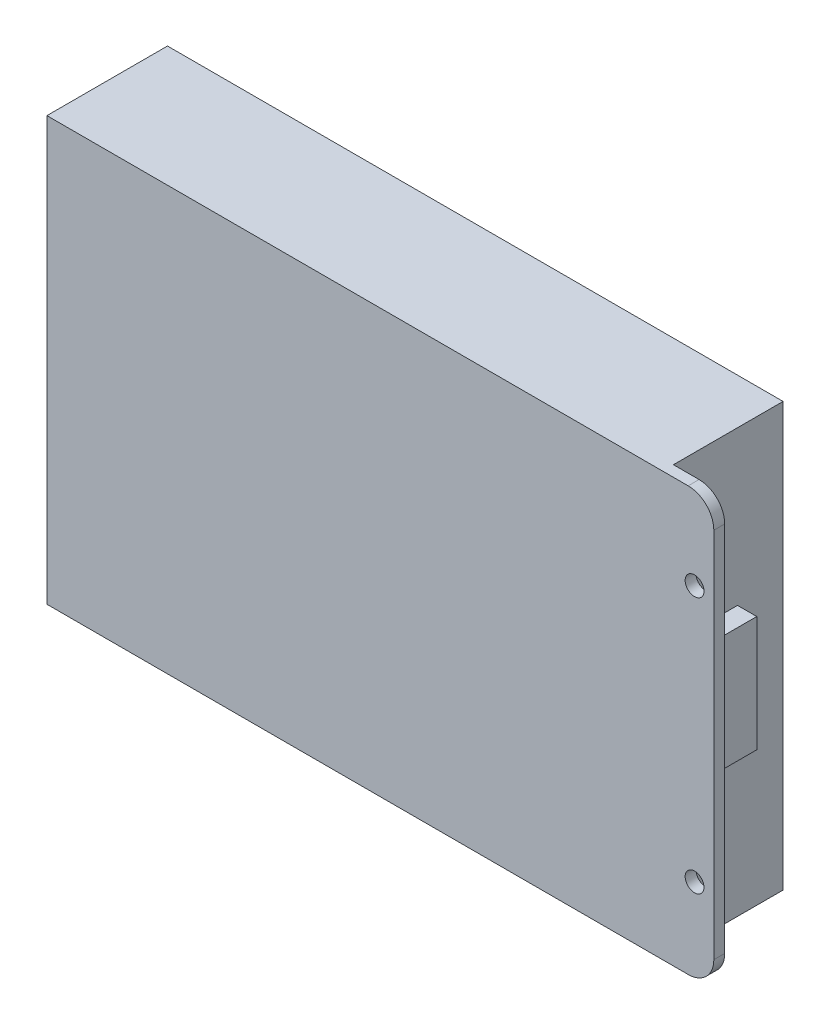
ISO-10303-21;
HEADER;
FILE_DESCRIPTION(('STEP AP214'),'2;1');
FILE_NAME('part.step','',(''),(''),'','','');
FILE_SCHEMA(('AUTOMOTIVE_DESIGN { 1 0 10303 214 1 1 1 1 }'));
ENDSEC;
DATA;
#1=APPLICATION_CONTEXT('core data for automotive mechanical design processes');
#2=APPLICATION_PROTOCOL_DEFINITION('international standard','automotive_design',2000,#1);
#3=PRODUCT_CONTEXT('',#1,'mechanical');
#4=PRODUCT('Part','Part','',(#3));
#5=PRODUCT_RELATED_PRODUCT_CATEGORY('part','',(#4));
#6=PRODUCT_DEFINITION_FORMATION('','',#4);
#7=PRODUCT_DEFINITION_CONTEXT('part definition',#1,'design');
#8=PRODUCT_DEFINITION('design','',#6,#7);
#9=PRODUCT_DEFINITION_SHAPE('','',#8);
#10=(LENGTH_UNIT() NAMED_UNIT(*) SI_UNIT(.MILLI.,.METRE.));
#11=(NAMED_UNIT(*) PLANE_ANGLE_UNIT() SI_UNIT($,.RADIAN.));
#12=(NAMED_UNIT(*) SI_UNIT($,.STERADIAN.) SOLID_ANGLE_UNIT());
#13=UNCERTAINTY_MEASURE_WITH_UNIT(LENGTH_MEASURE(1.E-05),#10,'distance_accuracy_value','');
#14=(GEOMETRIC_REPRESENTATION_CONTEXT(3) GLOBAL_UNCERTAINTY_ASSIGNED_CONTEXT((#13)) GLOBAL_UNIT_ASSIGNED_CONTEXT((#10,
#11,#12)) REPRESENTATION_CONTEXT('',''));
#15=CARTESIAN_POINT('',(0.,0.,0.));
#16=DIRECTION('',(0.,0.,1.));
#17=DIRECTION('',(1.,0.,0.));
#18=AXIS2_PLACEMENT_3D('',#15,#16,#17);
#19=CARTESIAN_POINT('',(48.,-33.,17.1));
#20=DIRECTION('',(-1.,0.,0.));
#21=DIRECTION('',(0.,0.,1.));
#22=AXIS2_PLACEMENT_3D('',#19,#20,#21);
#23=PLANE('',#22);
#24=DIRECTION('',(0.,0.,-1.));
#25=VECTOR('',#24,1.);
#26=CARTESIAN_POINT('',(48.,-9.,17.1));
#27=LINE('',#26,#25);
#28=CARTESIAN_POINT('',(48.,-9.,17.1));
#29=VERTEX_POINT('',#28);
#30=CARTESIAN_POINT('',(48.,-9.,7.1));
#31=VERTEX_POINT('',#30);
#32=EDGE_CURVE('E134',#29,#31,#27,.T.);
#33=ORIENTED_EDGE('',*,*,#32,.F.);
#34=DIRECTION('',(0.,1.,0.));
#35=VECTOR('',#34,1.);
#36=CARTESIAN_POINT('',(48.,-33.,17.1));
#37=LINE('',#36,#35);
#38=CARTESIAN_POINT('',(48.,-33.,17.1));
#39=VERTEX_POINT('',#38);
#40=EDGE_CURVE('E106',#39,#29,#37,.T.);
#41=ORIENTED_EDGE('',*,*,#40,.F.);
#42=DIRECTION('',(0.,0.,-1.));
#43=VECTOR('',#42,1.);
#44=CARTESIAN_POINT('',(48.,-33.,17.1));
#45=LINE('',#44,#43);
#46=CARTESIAN_POINT('',(48.,-33.,0.));
#47=VERTEX_POINT('',#46);
#48=EDGE_CURVE('E62',#39,#47,#45,.T.);
#49=ORIENTED_EDGE('',*,*,#48,.T.);
#50=DIRECTION('',(0.,1.,0.));
#51=VECTOR('',#50,1.);
#52=CARTESIAN_POINT('',(48.,-33.,0.));
#53=LINE('',#52,#51);
#54=CARTESIAN_POINT('',(48.,33.,0.));
#55=VERTEX_POINT('',#54);
#56=EDGE_CURVE('E102',#47,#55,#53,.T.);
#57=ORIENTED_EDGE('',*,*,#56,.T.);
#58=DIRECTION('',(0.,0.,-1.));
#59=VECTOR('',#58,1.);
#60=CARTESIAN_POINT('',(48.,33.,17.1));
#61=LINE('',#60,#59);
#62=CARTESIAN_POINT('',(48.,33.,17.1));
#63=VERTEX_POINT('',#62);
#64=EDGE_CURVE('E11',#63,#55,#61,.T.);
#65=ORIENTED_EDGE('',*,*,#64,.F.);
#66=CARTESIAN_POINT('',(48.,9.,17.1));
#67=VERTEX_POINT('',#66);
#68=EDGE_CURVE('E103',#67,#63,#37,.T.);
#69=ORIENTED_EDGE('',*,*,#68,.F.);
#70=DIRECTION('',(0.,0.,1.));
#71=VECTOR('',#70,1.);
#72=CARTESIAN_POINT('',(48.,9.,17.1));
#73=LINE('',#72,#71);
#74=CARTESIAN_POINT('',(48.,9.,7.1));
#75=VERTEX_POINT('',#74);
#76=EDGE_CURVE('E286',#75,#67,#73,.T.);
#77=ORIENTED_EDGE('',*,*,#76,.F.);
#78=DIRECTION('',(0.,1.,0.));
#79=VECTOR('',#78,1.);
#80=CARTESIAN_POINT('',(48.,9.,7.1));
#81=LINE('',#80,#79);
#82=EDGE_CURVE('E276',#31,#75,#81,.T.);
#83=ORIENTED_EDGE('',*,*,#82,.F.);
#84=EDGE_LOOP('',(#33,#41,#49,#57,#65,#69,#77,#83));
#85=FACE_BOUND('',#84,.T.);
#86=ADVANCED_FACE('F39',(#85),#23,.F.);
#87=CARTESIAN_POINT('',(52.,-29.,17.1));
#88=DIRECTION('',(0.,0.,1.));
#89=DIRECTION('',(1.,0.,0.));
#90=AXIS2_PLACEMENT_3D('',#87,#88,#89);
#91=PLANE('',#90);
#92=CARTESIAN_POINT('',(53.,20.,17.1));
#93=DIRECTION('',(0.,0.,1.));
#94=DIRECTION('',(1.,0.,0.));
#95=AXIS2_PLACEMENT_3D('',#92,#93,#94);
#96=CIRCLE('',#95,1.47);
#97=CARTESIAN_POINT('',(54.47,20.,17.1));
#98=VERTEX_POINT('',#97);
#99=EDGE_CURVE('E273',#98,#98,#96,.T.);
#100=ORIENTED_EDGE('',*,*,#99,.T.);
#101=EDGE_LOOP('',(#100));
#102=FACE_BOUND('',#101,.T.);
#103=CARTESIAN_POINT('',(53.,-20.,17.1));
#104=DIRECTION('',(0.,0.,1.));
#105=DIRECTION('',(1.,0.,0.));
#106=AXIS2_PLACEMENT_3D('',#103,#104,#105);
#107=CIRCLE('',#106,1.47);
#108=CARTESIAN_POINT('',(54.47,-20.,17.1));
#109=VERTEX_POINT('',#108);
#110=EDGE_CURVE('E274',#109,#109,#107,.T.);
#111=ORIENTED_EDGE('',*,*,#110,.T.);
#112=EDGE_LOOP('',(#111));
#113=FACE_BOUND('',#112,.T.);
#114=DIRECTION('',(-1.,0.,0.));
#115=VECTOR('',#114,1.);
#116=CARTESIAN_POINT('',(51.,-9.,17.1));
#117=LINE('',#116,#115);
#118=CARTESIAN_POINT('',(51.,-9.,17.1));
#119=VERTEX_POINT('',#118);
#120=EDGE_CURVE('E304',#119,#29,#117,.T.);
#121=ORIENTED_EDGE('',*,*,#120,.F.);
#122=DIRECTION('',(0.,-1.,0.));
#123=VECTOR('',#122,1.);
#124=CARTESIAN_POINT('',(51.,9.,17.1));
#125=LINE('',#124,#123);
#126=CARTESIAN_POINT('',(51.,9.,17.1));
#127=VERTEX_POINT('',#126);
#128=EDGE_CURVE('E282',#127,#119,#125,.T.);
#129=ORIENTED_EDGE('',*,*,#128,.F.);
#130=DIRECTION('',(-1.,0.,0.));
#131=VECTOR('',#130,1.);
#132=CARTESIAN_POINT('',(51.,9.,17.1));
#133=LINE('',#132,#131);
#134=EDGE_CURVE('E53',#127,#67,#133,.T.);
#135=ORIENTED_EDGE('',*,*,#134,.T.);
#136=ORIENTED_EDGE('',*,*,#68,.T.);
#137=DIRECTION('',(-1.,0.,0.));
#138=VECTOR('',#137,1.);
#139=CARTESIAN_POINT('',(-48.,33.,17.1));
#140=LINE('',#139,#138);
#141=CARTESIAN_POINT('',(52.,33.,17.1));
#142=VERTEX_POINT('',#141);
#143=EDGE_CURVE('E129',#142,#63,#140,.T.);
#144=ORIENTED_EDGE('',*,*,#143,.F.);
#145=CARTESIAN_POINT('',(52.,29.,17.1));
#146=DIRECTION('',(0.,0.,1.));
#147=DIRECTION('',(-1.,0.,0.));
#148=AXIS2_PLACEMENT_3D('',#145,#146,#147);
#149=CIRCLE('',#148,4.);
#150=CARTESIAN_POINT('',(56.,29.,17.1));
#151=VERTEX_POINT('',#150);
#152=EDGE_CURVE('E330',#151,#142,#149,.T.);
#153=ORIENTED_EDGE('',*,*,#152,.F.);
#154=DIRECTION('',(0.,1.,0.));
#155=VECTOR('',#154,1.);
#156=CARTESIAN_POINT('',(56.,29.,17.1));
#157=LINE('',#156,#155);
#158=CARTESIAN_POINT('',(56.,-29.,17.1));
#159=VERTEX_POINT('',#158);
#160=EDGE_CURVE('E327',#159,#151,#157,.T.);
#161=ORIENTED_EDGE('',*,*,#160,.F.);
#162=CARTESIAN_POINT('',(52.,-29.,17.1));
#163=DIRECTION('',(0.,0.,1.));
#164=DIRECTION('',(1.,0.,0.));
#165=AXIS2_PLACEMENT_3D('',#162,#163,#164);
#166=CIRCLE('',#165,4.);
#167=CARTESIAN_POINT('',(52.,-33.,17.1));
#168=VERTEX_POINT('',#167);
#169=EDGE_CURVE('E324',#168,#159,#166,.T.);
#170=ORIENTED_EDGE('',*,*,#169,.F.);
#171=DIRECTION('',(1.,0.,0.));
#172=VECTOR('',#171,1.);
#173=CARTESIAN_POINT('',(-48.,-33.,17.1));
#174=LINE('',#173,#172);
#175=EDGE_CURVE('E307',#39,#168,#174,.T.);
#176=ORIENTED_EDGE('',*,*,#175,.F.);
#177=ORIENTED_EDGE('',*,*,#40,.T.);
#178=EDGE_LOOP('',(#121,#129,#135,#136,#144,#153,#161,#170,#176,#177));
#179=FACE_BOUND('',#178,.T.);
#180=ADVANCED_FACE('F136',(#102,#113,#179),#91,.F.);
#181=CARTESIAN_POINT('',(-48.,33.,17.1));
#182=DIRECTION('',(0.,-1.,0.));
#183=DIRECTION('',(0.,0.,-1.));
#184=AXIS2_PLACEMENT_3D('',#181,#182,#183);
#185=PLANE('',#184);
#186=DIRECTION('',(-1.,0.,0.));
#187=VECTOR('',#186,1.);
#188=CARTESIAN_POINT('',(-48.,33.,0.));
#189=LINE('',#188,#187);
#190=CARTESIAN_POINT('',(-48.,33.,0.));
#191=VERTEX_POINT('',#190);
#192=EDGE_CURVE('E91',#55,#191,#189,.T.);
#193=ORIENTED_EDGE('',*,*,#192,.T.);
#194=DIRECTION('',(0.,0.,-1.));
#195=VECTOR('',#194,1.);
#196=CARTESIAN_POINT('',(-48.,33.,17.1));
#197=LINE('',#196,#195);
#198=CARTESIAN_POINT('',(-48.,33.,18.8));
#199=VERTEX_POINT('',#198);
#200=EDGE_CURVE('E46',#199,#191,#197,.T.);
#201=ORIENTED_EDGE('',*,*,#200,.F.);
#202=DIRECTION('',(-1.,0.,0.));
#203=VECTOR('',#202,1.);
#204=CARTESIAN_POINT('',(-48.,33.,18.8));
#205=LINE('',#204,#203);
#206=CARTESIAN_POINT('',(52.,33.,18.8));
#207=VERTEX_POINT('',#206);
#208=EDGE_CURVE('E320',#207,#199,#205,.T.);
#209=ORIENTED_EDGE('',*,*,#208,.F.);
#210=DIRECTION('',(0.,0.,-1.));
#211=VECTOR('',#210,1.);
#212=CARTESIAN_POINT('',(52.,33.,18.8));
#213=LINE('',#212,#211);
#214=EDGE_CURVE('E322',#207,#142,#213,.T.);
#215=ORIENTED_EDGE('',*,*,#214,.T.);
#216=ORIENTED_EDGE('',*,*,#143,.T.);
#217=ORIENTED_EDGE('',*,*,#64,.T.);
#218=EDGE_LOOP('',(#193,#201,#209,#215,#216,#217));
#219=FACE_BOUND('',#218,.T.);
#220=ADVANCED_FACE('F121',(#219),#185,.F.);
#221=CARTESIAN_POINT('',(-48.,-33.,17.1));
#222=DIRECTION('',(1.,0.,0.));
#223=DIRECTION('',(0.,0.,-1.));
#224=AXIS2_PLACEMENT_3D('',#221,#222,#223);
#225=PLANE('',#224);
#226=DIRECTION('',(0.,-1.,0.));
#227=VECTOR('',#226,1.);
#228=CARTESIAN_POINT('',(-48.,-33.,0.));
#229=LINE('',#228,#227);
#230=CARTESIAN_POINT('',(-48.,-33.,0.));
#231=VERTEX_POINT('',#230);
#232=EDGE_CURVE('E80',#191,#231,#229,.T.);
#233=ORIENTED_EDGE('',*,*,#232,.T.);
#234=DIRECTION('',(0.,0.,-1.));
#235=VECTOR('',#234,1.);
#236=CARTESIAN_POINT('',(-48.,-33.,17.1));
#237=LINE('',#236,#235);
#238=CARTESIAN_POINT('',(-48.,-33.,18.8));
#239=VERTEX_POINT('',#238);
#240=EDGE_CURVE('E85',#239,#231,#237,.T.);
#241=ORIENTED_EDGE('',*,*,#240,.F.);
#242=DIRECTION('',(0.,-1.,0.));
#243=VECTOR('',#242,1.);
#244=CARTESIAN_POINT('',(-48.,33.,18.8));
#245=LINE('',#244,#243);
#246=EDGE_CURVE('E308',#199,#239,#245,.T.);
#247=ORIENTED_EDGE('',*,*,#246,.F.);
#248=ORIENTED_EDGE('',*,*,#200,.T.);
#249=EDGE_LOOP('',(#233,#241,#247,#248));
#250=FACE_BOUND('',#249,.T.);
#251=ADVANCED_FACE('F82',(#250),#225,.F.);
#252=CARTESIAN_POINT('',(-48.,-33.,17.1));
#253=DIRECTION('',(0.,1.,0.));
#254=DIRECTION('',(0.,0.,1.));
#255=AXIS2_PLACEMENT_3D('',#252,#253,#254);
#256=PLANE('',#255);
#257=DIRECTION('',(1.,0.,0.));
#258=VECTOR('',#257,1.);
#259=CARTESIAN_POINT('',(-48.,-33.,0.));
#260=LINE('',#259,#258);
#261=EDGE_CURVE('E90',#231,#47,#260,.T.);
#262=ORIENTED_EDGE('',*,*,#261,.T.);
#263=ORIENTED_EDGE('',*,*,#48,.F.);
#264=ORIENTED_EDGE('',*,*,#175,.T.);
#265=DIRECTION('',(0.,0.,-1.));
#266=VECTOR('',#265,1.);
#267=CARTESIAN_POINT('',(52.,-33.,18.8));
#268=LINE('',#267,#266);
#269=CARTESIAN_POINT('',(52.,-33.,18.8));
#270=VERTEX_POINT('',#269);
#271=EDGE_CURVE('E118',#270,#168,#268,.T.);
#272=ORIENTED_EDGE('',*,*,#271,.F.);
#273=DIRECTION('',(1.,0.,0.));
#274=VECTOR('',#273,1.);
#275=CARTESIAN_POINT('',(-48.,-33.,18.8));
#276=LINE('',#275,#274);
#277=EDGE_CURVE('E96',#239,#270,#276,.T.);
#278=ORIENTED_EDGE('',*,*,#277,.F.);
#279=ORIENTED_EDGE('',*,*,#240,.T.);
#280=EDGE_LOOP('',(#262,#263,#264,#272,#278,#279));
#281=FACE_BOUND('',#280,.T.);
#282=ADVANCED_FACE('F93',(#281),#256,.F.);
#283=CARTESIAN_POINT('',(0.,0.,0.));
#284=DIRECTION('',(0.,0.,-1.));
#285=DIRECTION('',(-1.,0.,0.));
#286=AXIS2_PLACEMENT_3D('',#283,#284,#285);
#287=PLANE('',#286);
#288=ORIENTED_EDGE('',*,*,#56,.F.);
#289=ORIENTED_EDGE('',*,*,#261,.F.);
#290=ORIENTED_EDGE('',*,*,#232,.F.);
#291=ORIENTED_EDGE('',*,*,#192,.F.);
#292=EDGE_LOOP('',(#288,#289,#290,#291));
#293=FACE_BOUND('',#292,.T.);
#294=ADVANCED_FACE('F100',(#293),#287,.T.);
#295=CARTESIAN_POINT('',(52.,-29.,18.8));
#296=DIRECTION('',(0.,0.,-1.));
#297=DIRECTION('',(-1.,0.,0.));
#298=AXIS2_PLACEMENT_3D('',#295,#296,#297);
#299=CYLINDRICAL_SURFACE('',#298,4.);
#300=ORIENTED_EDGE('',*,*,#169,.T.);
#301=DIRECTION('',(0.,0.,-1.));
#302=VECTOR('',#301,1.);
#303=CARTESIAN_POINT('',(56.,-29.,18.8));
#304=LINE('',#303,#302);
#305=CARTESIAN_POINT('',(56.,-29.,18.8));
#306=VERTEX_POINT('',#305);
#307=EDGE_CURVE('E337',#306,#159,#304,.T.);
#308=ORIENTED_EDGE('',*,*,#307,.F.);
#309=CARTESIAN_POINT('',(52.,-29.,18.8));
#310=DIRECTION('',(0.,0.,1.));
#311=DIRECTION('',(1.,0.,0.));
#312=AXIS2_PLACEMENT_3D('',#309,#310,#311);
#313=CIRCLE('',#312,4.);
#314=EDGE_CURVE('E311',#270,#306,#313,.T.);
#315=ORIENTED_EDGE('',*,*,#314,.F.);
#316=ORIENTED_EDGE('',*,*,#271,.T.);
#317=EDGE_LOOP('',(#300,#308,#315,#316));
#318=FACE_BOUND('',#317,.T.);
#319=ADVANCED_FACE('F160',(#318),#299,.T.);
#320=CARTESIAN_POINT('',(56.,29.,18.8));
#321=DIRECTION('',(-1.,0.,0.));
#322=DIRECTION('',(0.,-1.,0.));
#323=AXIS2_PLACEMENT_3D('',#320,#321,#322);
#324=PLANE('',#323);
#325=ORIENTED_EDGE('',*,*,#160,.T.);
#326=DIRECTION('',(0.,0.,-1.));
#327=VECTOR('',#326,1.);
#328=CARTESIAN_POINT('',(56.,29.,18.8));
#329=LINE('',#328,#327);
#330=CARTESIAN_POINT('',(56.,29.,18.8));
#331=VERTEX_POINT('',#330);
#332=EDGE_CURVE('E335',#331,#151,#329,.T.);
#333=ORIENTED_EDGE('',*,*,#332,.F.);
#334=DIRECTION('',(0.,1.,0.));
#335=VECTOR('',#334,1.);
#336=CARTESIAN_POINT('',(56.,29.,18.8));
#337=LINE('',#336,#335);
#338=EDGE_CURVE('E314',#306,#331,#337,.T.);
#339=ORIENTED_EDGE('',*,*,#338,.F.);
#340=ORIENTED_EDGE('',*,*,#307,.T.);
#341=EDGE_LOOP('',(#325,#333,#339,#340));
#342=FACE_BOUND('',#341,.T.);
#343=ADVANCED_FACE('F156',(#342),#324,.F.);
#344=CARTESIAN_POINT('',(52.,29.,18.8));
#345=DIRECTION('',(0.,0.,-1.));
#346=DIRECTION('',(-1.,0.,0.));
#347=AXIS2_PLACEMENT_3D('',#344,#345,#346);
#348=CYLINDRICAL_SURFACE('',#347,4.);
#349=ORIENTED_EDGE('',*,*,#152,.T.);
#350=ORIENTED_EDGE('',*,*,#214,.F.);
#351=CARTESIAN_POINT('',(52.,29.,18.8));
#352=DIRECTION('',(0.,0.,1.));
#353=DIRECTION('',(-1.,0.,0.));
#354=AXIS2_PLACEMENT_3D('',#351,#352,#353);
#355=CIRCLE('',#354,4.);
#356=EDGE_CURVE('E317',#331,#207,#355,.T.);
#357=ORIENTED_EDGE('',*,*,#356,.F.);
#358=ORIENTED_EDGE('',*,*,#332,.T.);
#359=EDGE_LOOP('',(#349,#350,#357,#358));
#360=FACE_BOUND('',#359,.T.);
#361=ADVANCED_FACE('F153',(#360),#348,.T.);
#362=CARTESIAN_POINT('',(52.,-29.,18.8));
#363=DIRECTION('',(0.,0.,1.));
#364=DIRECTION('',(1.,0.,0.));
#365=AXIS2_PLACEMENT_3D('',#362,#363,#364);
#366=PLANE('',#365);
#367=CARTESIAN_POINT('',(53.,20.,18.8));
#368=DIRECTION('',(0.,0.,1.));
#369=DIRECTION('',(1.,0.,0.));
#370=AXIS2_PLACEMENT_3D('',#367,#368,#369);
#371=CIRCLE('',#370,1.47);
#372=CARTESIAN_POINT('',(54.47,20.,18.8));
#373=VERTEX_POINT('',#372);
#374=EDGE_CURVE('E271',#373,#373,#371,.T.);
#375=ORIENTED_EDGE('',*,*,#374,.F.);
#376=EDGE_LOOP('',(#375));
#377=FACE_BOUND('',#376,.T.);
#378=CARTESIAN_POINT('',(53.,-20.,18.8));
#379=DIRECTION('',(0.,0.,1.));
#380=DIRECTION('',(1.,0.,0.));
#381=AXIS2_PLACEMENT_3D('',#378,#379,#380);
#382=CIRCLE('',#381,1.47);
#383=CARTESIAN_POINT('',(54.47,-20.,18.8));
#384=VERTEX_POINT('',#383);
#385=EDGE_CURVE('E386',#384,#384,#382,.T.);
#386=ORIENTED_EDGE('',*,*,#385,.F.);
#387=EDGE_LOOP('',(#386));
#388=FACE_BOUND('',#387,.T.);
#389=ORIENTED_EDGE('',*,*,#246,.T.);
#390=ORIENTED_EDGE('',*,*,#277,.T.);
#391=ORIENTED_EDGE('',*,*,#314,.T.);
#392=ORIENTED_EDGE('',*,*,#338,.T.);
#393=ORIENTED_EDGE('',*,*,#356,.T.);
#394=ORIENTED_EDGE('',*,*,#208,.T.);
#395=EDGE_LOOP('',(#389,#390,#391,#392,#393,#394));
#396=FACE_BOUND('',#395,.T.);
#397=ADVANCED_FACE('F151',(#377,#388,#396),#366,.T.);
#398=CARTESIAN_POINT('',(51.,-9.,17.1));
#399=DIRECTION('',(0.,1.,0.));
#400=DIRECTION('',(0.,0.,1.));
#401=AXIS2_PLACEMENT_3D('',#398,#399,#400);
#402=PLANE('',#401);
#403=ORIENTED_EDGE('',*,*,#32,.T.);
#404=DIRECTION('',(-1.,0.,0.));
#405=VECTOR('',#404,1.);
#406=CARTESIAN_POINT('',(51.,-9.,7.1));
#407=LINE('',#406,#405);
#408=CARTESIAN_POINT('',(51.,-9.,7.1));
#409=VERTEX_POINT('',#408);
#410=EDGE_CURVE('E301',#409,#31,#407,.T.);
#411=ORIENTED_EDGE('',*,*,#410,.F.);
#412=DIRECTION('',(0.,0.,-1.));
#413=VECTOR('',#412,1.);
#414=CARTESIAN_POINT('',(51.,-9.,17.1));
#415=LINE('',#414,#413);
#416=EDGE_CURVE('E285',#119,#409,#415,.T.);
#417=ORIENTED_EDGE('',*,*,#416,.F.);
#418=ORIENTED_EDGE('',*,*,#120,.T.);
#419=EDGE_LOOP('',(#403,#411,#417,#418));
#420=FACE_BOUND('',#419,.T.);
#421=ADVANCED_FACE('F200',(#420),#402,.F.);
#422=CARTESIAN_POINT('',(51.,9.,7.1));
#423=DIRECTION('',(0.,0.,1.));
#424=DIRECTION('',(0.,-1.,0.));
#425=AXIS2_PLACEMENT_3D('',#422,#423,#424);
#426=PLANE('',#425);
#427=ORIENTED_EDGE('',*,*,#82,.T.);
#428=DIRECTION('',(-1.,0.,0.));
#429=VECTOR('',#428,1.);
#430=CARTESIAN_POINT('',(51.,9.,7.1));
#431=LINE('',#430,#429);
#432=CARTESIAN_POINT('',(51.,9.,7.1));
#433=VERTEX_POINT('',#432);
#434=EDGE_CURVE('E298',#433,#75,#431,.T.);
#435=ORIENTED_EDGE('',*,*,#434,.F.);
#436=DIRECTION('',(0.,1.,0.));
#437=VECTOR('',#436,1.);
#438=CARTESIAN_POINT('',(51.,9.,7.1));
#439=LINE('',#438,#437);
#440=EDGE_CURVE('E289',#409,#433,#439,.T.);
#441=ORIENTED_EDGE('',*,*,#440,.F.);
#442=ORIENTED_EDGE('',*,*,#410,.T.);
#443=EDGE_LOOP('',(#427,#435,#441,#442));
#444=FACE_BOUND('',#443,.T.);
#445=ADVANCED_FACE('F210',(#444),#426,.F.);
#446=CARTESIAN_POINT('',(51.,9.,17.1));
#447=DIRECTION('',(0.,-1.,0.));
#448=DIRECTION('',(0.,0.,-1.));
#449=AXIS2_PLACEMENT_3D('',#446,#447,#448);
#450=PLANE('',#449);
#451=ORIENTED_EDGE('',*,*,#76,.T.);
#452=ORIENTED_EDGE('',*,*,#134,.F.);
#453=DIRECTION('',(0.,0.,1.));
#454=VECTOR('',#453,1.);
#455=CARTESIAN_POINT('',(51.,9.,17.1));
#456=LINE('',#455,#454);
#457=EDGE_CURVE('E292',#433,#127,#456,.T.);
#458=ORIENTED_EDGE('',*,*,#457,.F.);
#459=ORIENTED_EDGE('',*,*,#434,.T.);
#460=EDGE_LOOP('',(#451,#452,#458,#459));
#461=FACE_BOUND('',#460,.T.);
#462=ADVANCED_FACE('F217',(#461),#450,.F.);
#463=CARTESIAN_POINT('',(51.,0.,0.));
#464=DIRECTION('',(1.,0.,0.));
#465=DIRECTION('',(0.,0.,-1.));
#466=AXIS2_PLACEMENT_3D('',#463,#464,#465);
#467=PLANE('',#466);
#468=ORIENTED_EDGE('',*,*,#128,.T.);
#469=ORIENTED_EDGE('',*,*,#416,.T.);
#470=ORIENTED_EDGE('',*,*,#440,.T.);
#471=ORIENTED_EDGE('',*,*,#457,.T.);
#472=EDGE_LOOP('',(#468,#469,#470,#471));
#473=FACE_BOUND('',#472,.T.);
#474=ADVANCED_FACE('F225',(#473),#467,.T.);
#475=CARTESIAN_POINT('',(53.,-20.,0.));
#476=DIRECTION('',(0.,0.,1.));
#477=DIRECTION('',(1.,0.,0.));
#478=AXIS2_PLACEMENT_3D('',#475,#476,#477);
#479=CYLINDRICAL_SURFACE('',#478,1.47);
#480=ORIENTED_EDGE('',*,*,#385,.T.);
#481=EDGE_LOOP('',(#480));
#482=FACE_BOUND('',#481,.T.);
#483=ORIENTED_EDGE('',*,*,#110,.F.);
#484=EDGE_LOOP('',(#483));
#485=FACE_BOUND('',#484,.T.);
#486=ADVANCED_FACE('F231',(#482,#485),#479,.F.);
#487=CARTESIAN_POINT('',(53.,20.,0.));
#488=DIRECTION('',(0.,0.,1.));
#489=DIRECTION('',(1.,0.,0.));
#490=AXIS2_PLACEMENT_3D('',#487,#488,#489);
#491=CYLINDRICAL_SURFACE('',#490,1.47);
#492=ORIENTED_EDGE('',*,*,#374,.T.);
#493=EDGE_LOOP('',(#492));
#494=FACE_BOUND('',#493,.T.);
#495=ORIENTED_EDGE('',*,*,#99,.F.);
#496=EDGE_LOOP('',(#495));
#497=FACE_BOUND('',#496,.T.);
#498=ADVANCED_FACE('F238',(#494,#497),#491,.F.);
#499=CLOSED_SHELL('',(#86,#180,#220,#251,#282,#294,#319,#343,#361,#397,#421,#445,#462,#474,#486,#498));
#500=MANIFOLD_SOLID_BREP('B2',#499);
#501=ADVANCED_BREP_SHAPE_REPRESENTATION('',(#18,#500),#14);
#502=SHAPE_DEFINITION_REPRESENTATION(#9,#501);
ENDSEC;
END-ISO-10303-21;
